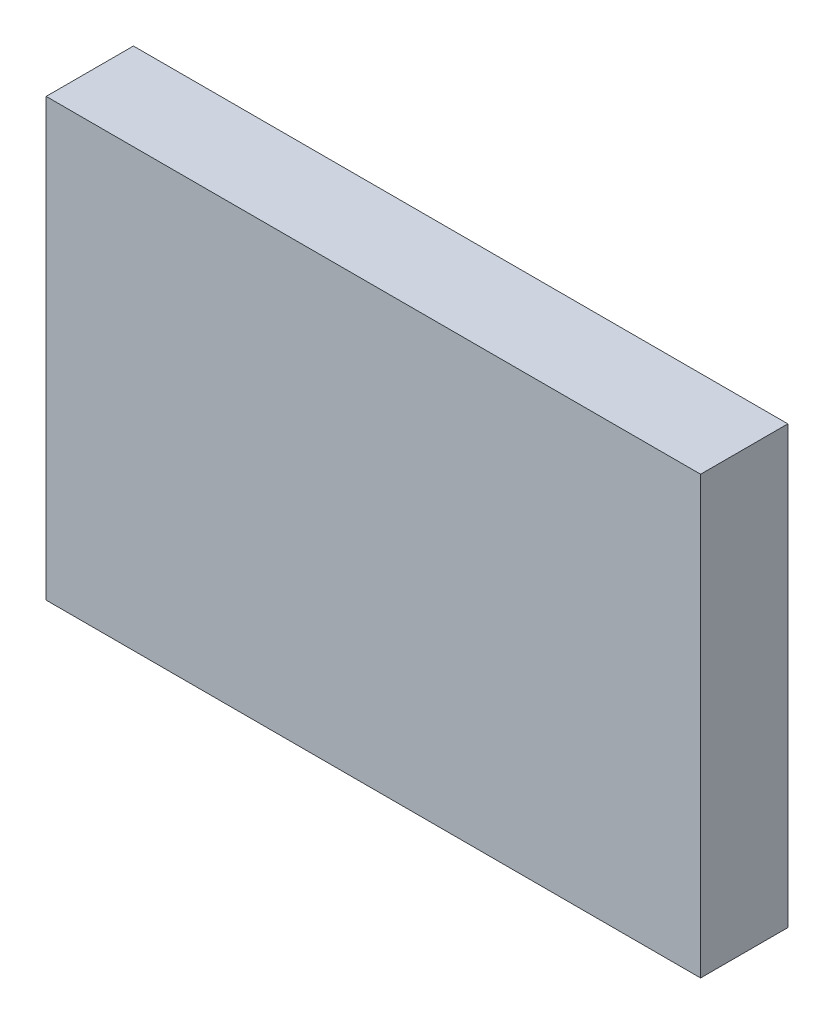
ISO-10303-21;
HEADER;
FILE_DESCRIPTION(('STEP AP214'),'2;1');
FILE_NAME('part.step','',(''),(''),'','','');
FILE_SCHEMA(('AUTOMOTIVE_DESIGN { 1 0 10303 214 1 1 1 1 }'));
ENDSEC;
DATA;
#1=APPLICATION_CONTEXT('core data for automotive mechanical design processes');
#2=APPLICATION_PROTOCOL_DEFINITION('international standard','automotive_design',2000,#1);
#3=PRODUCT_CONTEXT('',#1,'mechanical');
#4=PRODUCT('Part','Part','',(#3));
#5=PRODUCT_RELATED_PRODUCT_CATEGORY('part','',(#4));
#6=PRODUCT_DEFINITION_FORMATION('','',#4);
#7=PRODUCT_DEFINITION_CONTEXT('part definition',#1,'design');
#8=PRODUCT_DEFINITION('design','',#6,#7);
#9=PRODUCT_DEFINITION_SHAPE('','',#8);
#10=(LENGTH_UNIT() NAMED_UNIT(*) SI_UNIT(.MILLI.,.METRE.));
#11=(NAMED_UNIT(*) PLANE_ANGLE_UNIT() SI_UNIT($,.RADIAN.));
#12=(NAMED_UNIT(*) SI_UNIT($,.STERADIAN.) SOLID_ANGLE_UNIT());
#13=UNCERTAINTY_MEASURE_WITH_UNIT(LENGTH_MEASURE(1.E-05),#10,'distance_accuracy_value','');
#14=(GEOMETRIC_REPRESENTATION_CONTEXT(3) GLOBAL_UNCERTAINTY_ASSIGNED_CONTEXT((#13)) GLOBAL_UNIT_ASSIGNED_CONTEXT((#10,
#11,#12)) REPRESENTATION_CONTEXT('',''));
#15=CARTESIAN_POINT('',(0.,0.,0.));
#16=DIRECTION('',(0.,0.,1.));
#17=DIRECTION('',(1.,0.,0.));
#18=AXIS2_PLACEMENT_3D('',#15,#16,#17);
#19=CARTESIAN_POINT('',(75.,50.,20.));
#20=DIRECTION('',(-1.,0.,0.));
#21=DIRECTION('',(0.,0.,1.));
#22=AXIS2_PLACEMENT_3D('',#19,#20,#21);
#23=PLANE('',#22);
#24=DIRECTION('',(0.,1.,0.));
#25=VECTOR('',#24,1.);
#26=CARTESIAN_POINT('',(75.,50.,0.));
#27=LINE('',#26,#25);
#28=CARTESIAN_POINT('',(75.,-50.,0.));
#29=VERTEX_POINT('',#28);
#30=CARTESIAN_POINT('',(75.,50.,0.));
#31=VERTEX_POINT('',#30);
#32=EDGE_CURVE('E98',#29,#31,#27,.T.);
#33=ORIENTED_EDGE('',*,*,#32,.T.);
#34=DIRECTION('',(0.,0.,-1.));
#35=VECTOR('',#34,1.);
#36=CARTESIAN_POINT('',(75.,50.,20.));
#37=LINE('',#36,#35);
#38=CARTESIAN_POINT('',(75.,50.,20.));
#39=VERTEX_POINT('',#38);
#40=EDGE_CURVE('E11',#39,#31,#37,.T.);
#41=ORIENTED_EDGE('',*,*,#40,.F.);
#42=DIRECTION('',(0.,1.,0.));
#43=VECTOR('',#42,1.);
#44=CARTESIAN_POINT('',(75.,50.,20.));
#45=LINE('',#44,#43);
#46=CARTESIAN_POINT('',(75.,-50.,20.));
#47=VERTEX_POINT('',#46);
#48=EDGE_CURVE('E86',#47,#39,#45,.T.);
#49=ORIENTED_EDGE('',*,*,#48,.F.);
#50=DIRECTION('',(0.,0.,-1.));
#51=VECTOR('',#50,1.);
#52=CARTESIAN_POINT('',(75.,-50.,20.));
#53=LINE('',#52,#51);
#54=EDGE_CURVE('E94',#47,#29,#53,.T.);
#55=ORIENTED_EDGE('',*,*,#54,.T.);
#56=EDGE_LOOP('',(#33,#41,#49,#55));
#57=FACE_BOUND('',#56,.T.);
#58=ADVANCED_FACE('F35',(#57),#23,.F.);
#59=CARTESIAN_POINT('',(-75.,50.,20.));
#60=DIRECTION('',(0.,-1.,0.));
#61=DIRECTION('',(0.,0.,-1.));
#62=AXIS2_PLACEMENT_3D('',#59,#60,#61);
#63=PLANE('',#62);
#64=DIRECTION('',(-1.,0.,0.));
#65=VECTOR('',#64,1.);
#66=CARTESIAN_POINT('',(-75.,50.,0.));
#67=LINE('',#66,#65);
#68=CARTESIAN_POINT('',(-75.,50.,0.));
#69=VERTEX_POINT('',#68);
#70=EDGE_CURVE('E90',#31,#69,#67,.T.);
#71=ORIENTED_EDGE('',*,*,#70,.T.);
#72=DIRECTION('',(0.,0.,-1.));
#73=VECTOR('',#72,1.);
#74=CARTESIAN_POINT('',(-75.,50.,20.));
#75=LINE('',#74,#73);
#76=CARTESIAN_POINT('',(-75.,50.,20.));
#77=VERTEX_POINT('',#76);
#78=EDGE_CURVE('E43',#77,#69,#75,.T.);
#79=ORIENTED_EDGE('',*,*,#78,.F.);
#80=DIRECTION('',(-1.,0.,0.));
#81=VECTOR('',#80,1.);
#82=CARTESIAN_POINT('',(-75.,50.,20.));
#83=LINE('',#82,#81);
#84=EDGE_CURVE('E81',#39,#77,#83,.T.);
#85=ORIENTED_EDGE('',*,*,#84,.F.);
#86=ORIENTED_EDGE('',*,*,#40,.T.);
#87=EDGE_LOOP('',(#71,#79,#85,#86));
#88=FACE_BOUND('',#87,.T.);
#89=ADVANCED_FACE('F89',(#88),#63,.F.);
#90=CARTESIAN_POINT('',(-75.,50.,20.));
#91=DIRECTION('',(1.,0.,0.));
#92=DIRECTION('',(0.,1.,0.));
#93=AXIS2_PLACEMENT_3D('',#90,#91,#92);
#94=PLANE('',#93);
#95=DIRECTION('',(0.,-1.,0.));
#96=VECTOR('',#95,1.);
#97=CARTESIAN_POINT('',(-75.,50.,0.));
#98=LINE('',#97,#96);
#99=CARTESIAN_POINT('',(-75.,-50.,0.));
#100=VERTEX_POINT('',#99);
#101=EDGE_CURVE('E68',#69,#100,#98,.T.);
#102=ORIENTED_EDGE('',*,*,#101,.T.);
#103=DIRECTION('',(0.,0.,-1.));
#104=VECTOR('',#103,1.);
#105=CARTESIAN_POINT('',(-75.,-50.,20.));
#106=LINE('',#105,#104);
#107=CARTESIAN_POINT('',(-75.,-50.,20.));
#108=VERTEX_POINT('',#107);
#109=EDGE_CURVE('E91',#108,#100,#106,.T.);
#110=ORIENTED_EDGE('',*,*,#109,.F.);
#111=DIRECTION('',(0.,-1.,0.));
#112=VECTOR('',#111,1.);
#113=CARTESIAN_POINT('',(-75.,50.,20.));
#114=LINE('',#113,#112);
#115=EDGE_CURVE('E84',#77,#108,#114,.T.);
#116=ORIENTED_EDGE('',*,*,#115,.F.);
#117=ORIENTED_EDGE('',*,*,#78,.T.);
#118=EDGE_LOOP('',(#102,#110,#116,#117));
#119=FACE_BOUND('',#118,.T.);
#120=ADVANCED_FACE('F92',(#119),#94,.F.);
#121=CARTESIAN_POINT('',(-75.,-50.,20.));
#122=DIRECTION('',(0.,1.,0.));
#123=DIRECTION('',(0.,0.,1.));
#124=AXIS2_PLACEMENT_3D('',#121,#122,#123);
#125=PLANE('',#124);
#126=DIRECTION('',(1.,0.,0.));
#127=VECTOR('',#126,1.);
#128=CARTESIAN_POINT('',(-75.,-50.,0.));
#129=LINE('',#128,#127);
#130=EDGE_CURVE('E74',#100,#29,#129,.T.);
#131=ORIENTED_EDGE('',*,*,#130,.T.);
#132=ORIENTED_EDGE('',*,*,#54,.F.);
#133=DIRECTION('',(1.,0.,0.));
#134=VECTOR('',#133,1.);
#135=CARTESIAN_POINT('',(-75.,-50.,20.));
#136=LINE('',#135,#134);
#137=EDGE_CURVE('E51',#108,#47,#136,.T.);
#138=ORIENTED_EDGE('',*,*,#137,.F.);
#139=ORIENTED_EDGE('',*,*,#109,.T.);
#140=EDGE_LOOP('',(#131,#132,#138,#139));
#141=FACE_BOUND('',#140,.T.);
#142=ADVANCED_FACE('F105',(#141),#125,.F.);
#143=CARTESIAN_POINT('',(0.,0.,20.));
#144=DIRECTION('',(0.,0.,1.));
#145=DIRECTION('',(1.,0.,0.));
#146=AXIS2_PLACEMENT_3D('',#143,#144,#145);
#147=PLANE('',#146);
#148=ORIENTED_EDGE('',*,*,#48,.T.);
#149=ORIENTED_EDGE('',*,*,#84,.T.);
#150=ORIENTED_EDGE('',*,*,#115,.T.);
#151=ORIENTED_EDGE('',*,*,#137,.T.);
#152=EDGE_LOOP('',(#148,#149,#150,#151));
#153=FACE_BOUND('',#152,.T.);
#154=ADVANCED_FACE('F82',(#153),#147,.T.);
#155=CARTESIAN_POINT('',(0.,0.,0.));
#156=DIRECTION('',(0.,0.,1.));
#157=DIRECTION('',(1.,0.,0.));
#158=AXIS2_PLACEMENT_3D('',#155,#156,#157);
#159=PLANE('',#158);
#160=ORIENTED_EDGE('',*,*,#32,.F.);
#161=ORIENTED_EDGE('',*,*,#130,.F.);
#162=ORIENTED_EDGE('',*,*,#101,.F.);
#163=ORIENTED_EDGE('',*,*,#70,.F.);
#164=EDGE_LOOP('',(#160,#161,#162,#163));
#165=FACE_BOUND('',#164,.T.);
#166=ADVANCED_FACE('F108',(#165),#159,.F.);
#167=CLOSED_SHELL('',(#58,#89,#120,#142,#154,#166));
#168=MANIFOLD_SOLID_BREP('B2',#167);
#169=ADVANCED_BREP_SHAPE_REPRESENTATION('',(#18,#168),#14);
#170=SHAPE_DEFINITION_REPRESENTATION(#9,#169);
ENDSEC;
END-ISO-10303-21;
